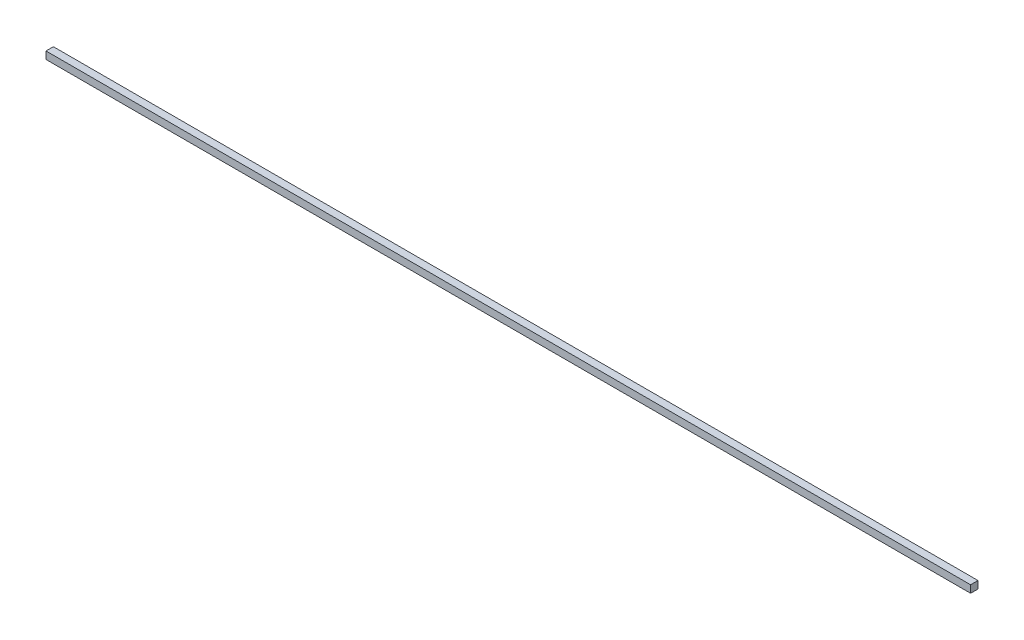
ISO-10303-21;
HEADER;
FILE_DESCRIPTION(('STEP AP214'),'2;1');
FILE_NAME('part.step','',(''),(''),'','','');
FILE_SCHEMA(('AUTOMOTIVE_DESIGN { 1 0 10303 214 1 1 1 1 }'));
ENDSEC;
DATA;
#1=APPLICATION_CONTEXT('core data for automotive mechanical design processes');
#2=APPLICATION_PROTOCOL_DEFINITION('international standard','automotive_design',2000,#1);
#3=PRODUCT_CONTEXT('',#1,'mechanical');
#4=PRODUCT('Part','Part','',(#3));
#5=PRODUCT_RELATED_PRODUCT_CATEGORY('part','',(#4));
#6=PRODUCT_DEFINITION_FORMATION('','',#4);
#7=PRODUCT_DEFINITION_CONTEXT('part definition',#1,'design');
#8=PRODUCT_DEFINITION('design','',#6,#7);
#9=PRODUCT_DEFINITION_SHAPE('','',#8);
#10=(LENGTH_UNIT() NAMED_UNIT(*) SI_UNIT(.MILLI.,.METRE.));
#11=(NAMED_UNIT(*) PLANE_ANGLE_UNIT() SI_UNIT($,.RADIAN.));
#12=(NAMED_UNIT(*) SI_UNIT($,.STERADIAN.) SOLID_ANGLE_UNIT());
#13=UNCERTAINTY_MEASURE_WITH_UNIT(LENGTH_MEASURE(1.E-05),#10,'distance_accuracy_value','');
#14=(GEOMETRIC_REPRESENTATION_CONTEXT(3) GLOBAL_UNCERTAINTY_ASSIGNED_CONTEXT((#13)) GLOBAL_UNIT_ASSIGNED_CONTEXT((#10,
#11,#12)) REPRESENTATION_CONTEXT('',''));
#15=CARTESIAN_POINT('',(0.,0.,0.));
#16=DIRECTION('',(0.,0.,1.));
#17=DIRECTION('',(1.,0.,0.));
#18=AXIS2_PLACEMENT_3D('',#15,#16,#17);
#19=CARTESIAN_POINT('',(-625.,10.,-4.99999999999998));
#20=DIRECTION('',(1.,0.,0.));
#21=DIRECTION('',(0.,0.,-1.));
#22=AXIS2_PLACEMENT_3D('',#19,#20,#21);
#23=PLANE('',#22);
#24=DIRECTION('',(0.,0.,1.));
#25=VECTOR('',#24,1.);
#26=CARTESIAN_POINT('',(-625.,0.,-4.99999999999998));
#27=LINE('',#26,#25);
#28=CARTESIAN_POINT('',(-625.,0.,-4.99999999999998));
#29=VERTEX_POINT('',#28);
#30=CARTESIAN_POINT('',(-625.,0.,5.00000000000003));
#31=VERTEX_POINT('',#30);
#32=EDGE_CURVE('E97',#29,#31,#27,.T.);
#33=ORIENTED_EDGE('',*,*,#32,.T.);
#34=DIRECTION('',(0.,-1.,0.));
#35=VECTOR('',#34,1.);
#36=CARTESIAN_POINT('',(-625.,10.,5.00000000000003));
#37=LINE('',#36,#35);
#38=CARTESIAN_POINT('',(-625.,10.,5.00000000000003));
#39=VERTEX_POINT('',#38);
#40=EDGE_CURVE('E11',#39,#31,#37,.T.);
#41=ORIENTED_EDGE('',*,*,#40,.F.);
#42=DIRECTION('',(0.,0.,1.));
#43=VECTOR('',#42,1.);
#44=CARTESIAN_POINT('',(-625.,10.,-4.99999999999998));
#45=LINE('',#44,#43);
#46=CARTESIAN_POINT('',(-625.,10.,-4.99999999999998));
#47=VERTEX_POINT('',#46);
#48=EDGE_CURVE('E85',#47,#39,#45,.T.);
#49=ORIENTED_EDGE('',*,*,#48,.F.);
#50=DIRECTION('',(0.,-1.,0.));
#51=VECTOR('',#50,1.);
#52=CARTESIAN_POINT('',(-625.,10.,-4.99999999999998));
#53=LINE('',#52,#51);
#54=EDGE_CURVE('E93',#47,#29,#53,.T.);
#55=ORIENTED_EDGE('',*,*,#54,.T.);
#56=EDGE_LOOP('',(#33,#41,#49,#55));
#57=FACE_BOUND('',#56,.T.);
#58=ADVANCED_FACE('F34',(#57),#23,.F.);
#59=CARTESIAN_POINT('',(-625.,10.,5.00000000000003));
#60=DIRECTION('',(0.,0.,-1.));
#61=DIRECTION('',(-1.,0.,0.));
#62=AXIS2_PLACEMENT_3D('',#59,#60,#61);
#63=PLANE('',#62);
#64=DIRECTION('',(1.,0.,0.));
#65=VECTOR('',#64,1.);
#66=CARTESIAN_POINT('',(-625.,0.,5.00000000000003));
#67=LINE('',#66,#65);
#68=CARTESIAN_POINT('',(625.,0.,5.00000000000003));
#69=VERTEX_POINT('',#68);
#70=EDGE_CURVE('E89',#31,#69,#67,.T.);
#71=ORIENTED_EDGE('',*,*,#70,.T.);
#72=DIRECTION('',(0.,-1.,0.));
#73=VECTOR('',#72,1.);
#74=CARTESIAN_POINT('',(625.,10.,5.00000000000003));
#75=LINE('',#74,#73);
#76=CARTESIAN_POINT('',(625.,10.,5.00000000000003));
#77=VERTEX_POINT('',#76);
#78=EDGE_CURVE('E42',#77,#69,#75,.T.);
#79=ORIENTED_EDGE('',*,*,#78,.F.);
#80=DIRECTION('',(1.,0.,0.));
#81=VECTOR('',#80,1.);
#82=CARTESIAN_POINT('',(-625.,10.,5.00000000000003));
#83=LINE('',#82,#81);
#84=EDGE_CURVE('E80',#39,#77,#83,.T.);
#85=ORIENTED_EDGE('',*,*,#84,.F.);
#86=ORIENTED_EDGE('',*,*,#40,.T.);
#87=EDGE_LOOP('',(#71,#79,#85,#86));
#88=FACE_BOUND('',#87,.T.);
#89=ADVANCED_FACE('F88',(#88),#63,.F.);
#90=CARTESIAN_POINT('',(625.,10.,-4.99999999999998));
#91=DIRECTION('',(-1.,0.,0.));
#92=DIRECTION('',(0.,0.,1.));
#93=AXIS2_PLACEMENT_3D('',#90,#91,#92);
#94=PLANE('',#93);
#95=DIRECTION('',(0.,0.,-1.));
#96=VECTOR('',#95,1.);
#97=CARTESIAN_POINT('',(625.,0.,-4.99999999999998));
#98=LINE('',#97,#96);
#99=CARTESIAN_POINT('',(625.,0.,-4.99999999999998));
#100=VERTEX_POINT('',#99);
#101=EDGE_CURVE('E67',#69,#100,#98,.T.);
#102=ORIENTED_EDGE('',*,*,#101,.T.);
#103=DIRECTION('',(0.,-1.,0.));
#104=VECTOR('',#103,1.);
#105=CARTESIAN_POINT('',(625.,10.,-4.99999999999998));
#106=LINE('',#105,#104);
#107=CARTESIAN_POINT('',(625.,10.,-4.99999999999998));
#108=VERTEX_POINT('',#107);
#109=EDGE_CURVE('E90',#108,#100,#106,.T.);
#110=ORIENTED_EDGE('',*,*,#109,.F.);
#111=DIRECTION('',(0.,0.,-1.));
#112=VECTOR('',#111,1.);
#113=CARTESIAN_POINT('',(625.,10.,-4.99999999999998));
#114=LINE('',#113,#112);
#115=EDGE_CURVE('E83',#77,#108,#114,.T.);
#116=ORIENTED_EDGE('',*,*,#115,.F.);
#117=ORIENTED_EDGE('',*,*,#78,.T.);
#118=EDGE_LOOP('',(#102,#110,#116,#117));
#119=FACE_BOUND('',#118,.T.);
#120=ADVANCED_FACE('F91',(#119),#94,.F.);
#121=CARTESIAN_POINT('',(-625.,10.,-4.99999999999998));
#122=DIRECTION('',(0.,0.,1.));
#123=DIRECTION('',(1.,0.,0.));
#124=AXIS2_PLACEMENT_3D('',#121,#122,#123);
#125=PLANE('',#124);
#126=DIRECTION('',(-1.,0.,0.));
#127=VECTOR('',#126,1.);
#128=CARTESIAN_POINT('',(-625.,0.,-4.99999999999998));
#129=LINE('',#128,#127);
#130=EDGE_CURVE('E73',#100,#29,#129,.T.);
#131=ORIENTED_EDGE('',*,*,#130,.T.);
#132=ORIENTED_EDGE('',*,*,#54,.F.);
#133=DIRECTION('',(-1.,0.,0.));
#134=VECTOR('',#133,1.);
#135=CARTESIAN_POINT('',(-625.,10.,-4.99999999999998));
#136=LINE('',#135,#134);
#137=EDGE_CURVE('E50',#108,#47,#136,.T.);
#138=ORIENTED_EDGE('',*,*,#137,.F.);
#139=ORIENTED_EDGE('',*,*,#109,.T.);
#140=EDGE_LOOP('',(#131,#132,#138,#139));
#141=FACE_BOUND('',#140,.T.);
#142=ADVANCED_FACE('F104',(#141),#125,.F.);
#143=CARTESIAN_POINT('',(0.,10.,0.));
#144=DIRECTION('',(0.,1.,0.));
#145=DIRECTION('',(0.,0.,1.));
#146=AXIS2_PLACEMENT_3D('',#143,#144,#145);
#147=PLANE('',#146);
#148=ORIENTED_EDGE('',*,*,#48,.T.);
#149=ORIENTED_EDGE('',*,*,#84,.T.);
#150=ORIENTED_EDGE('',*,*,#115,.T.);
#151=ORIENTED_EDGE('',*,*,#137,.T.);
#152=EDGE_LOOP('',(#148,#149,#150,#151));
#153=FACE_BOUND('',#152,.T.);
#154=ADVANCED_FACE('F81',(#153),#147,.T.);
#155=CARTESIAN_POINT('',(0.,0.,0.));
#156=DIRECTION('',(0.,1.,0.));
#157=DIRECTION('',(0.,0.,1.));
#158=AXIS2_PLACEMENT_3D('',#155,#156,#157);
#159=PLANE('',#158);
#160=ORIENTED_EDGE('',*,*,#32,.F.);
#161=ORIENTED_EDGE('',*,*,#130,.F.);
#162=ORIENTED_EDGE('',*,*,#101,.F.);
#163=ORIENTED_EDGE('',*,*,#70,.F.);
#164=EDGE_LOOP('',(#160,#161,#162,#163));
#165=FACE_BOUND('',#164,.T.);
#166=ADVANCED_FACE('F107',(#165),#159,.F.);
#167=CLOSED_SHELL('',(#58,#89,#120,#142,#154,#166));
#168=MANIFOLD_SOLID_BREP('B2',#167);
#169=ADVANCED_BREP_SHAPE_REPRESENTATION('',(#18,#168),#14);
#170=SHAPE_DEFINITION_REPRESENTATION(#9,#169);
ENDSEC;
END-ISO-10303-21;
